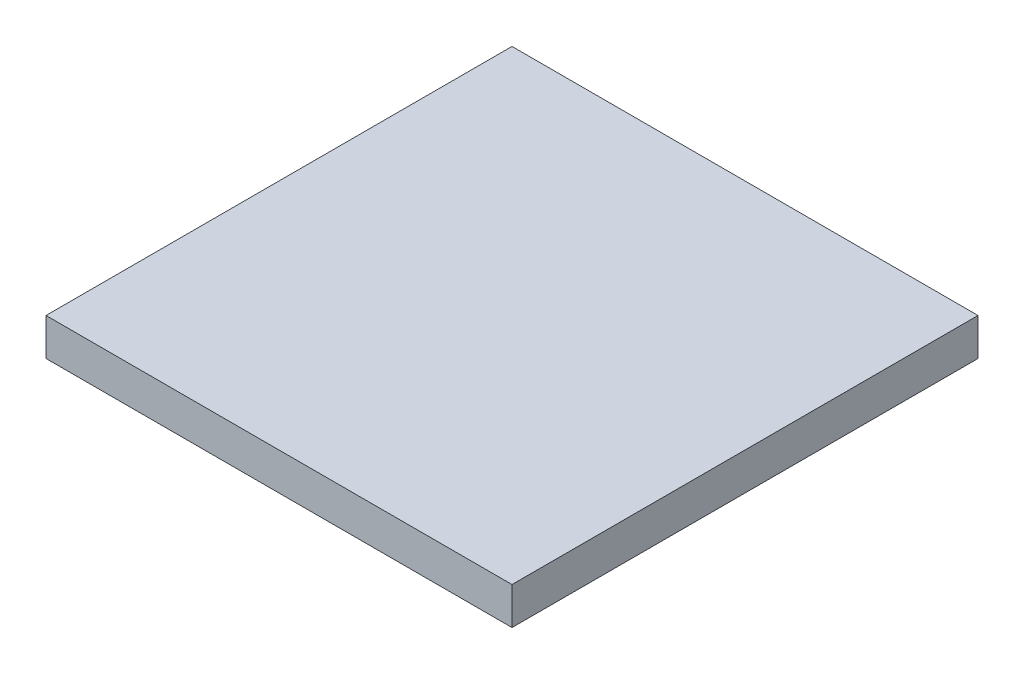
ISO-10303-21;
HEADER;
FILE_DESCRIPTION(('STEP AP214'),'2;1');
FILE_NAME('part.step','',(''),(''),'','','');
FILE_SCHEMA(('AUTOMOTIVE_DESIGN { 1 0 10303 214 1 1 1 1 }'));
ENDSEC;
DATA;
#1=APPLICATION_CONTEXT('core data for automotive mechanical design processes');
#2=APPLICATION_PROTOCOL_DEFINITION('international standard','automotive_design',2000,#1);
#3=PRODUCT_CONTEXT('',#1,'mechanical');
#4=PRODUCT('Part','Part','',(#3));
#5=PRODUCT_RELATED_PRODUCT_CATEGORY('part','',(#4));
#6=PRODUCT_DEFINITION_FORMATION('','',#4);
#7=PRODUCT_DEFINITION_CONTEXT('part definition',#1,'design');
#8=PRODUCT_DEFINITION('design','',#6,#7);
#9=PRODUCT_DEFINITION_SHAPE('','',#8);
#10=(LENGTH_UNIT() NAMED_UNIT(*) SI_UNIT(.MILLI.,.METRE.));
#11=(NAMED_UNIT(*) PLANE_ANGLE_UNIT() SI_UNIT($,.RADIAN.));
#12=(NAMED_UNIT(*) SI_UNIT($,.STERADIAN.) SOLID_ANGLE_UNIT());
#13=UNCERTAINTY_MEASURE_WITH_UNIT(LENGTH_MEASURE(1.E-05),#10,'distance_accuracy_value','');
#14=(GEOMETRIC_REPRESENTATION_CONTEXT(3) GLOBAL_UNCERTAINTY_ASSIGNED_CONTEXT((#13)) GLOBAL_UNIT_ASSIGNED_CONTEXT((#10,
#11,#12)) REPRESENTATION_CONTEXT('',''));
#15=CARTESIAN_POINT('',(0.,0.,0.));
#16=DIRECTION('',(0.,0.,1.));
#17=DIRECTION('',(1.,0.,0.));
#18=AXIS2_PLACEMENT_3D('',#15,#16,#17);
#19=CARTESIAN_POINT('',(12.5,2.,-12.5));
#20=DIRECTION('',(-1.,0.,0.));
#21=DIRECTION('',(0.,0.,1.));
#22=AXIS2_PLACEMENT_3D('',#19,#20,#21);
#23=PLANE('',#22);
#24=DIRECTION('',(0.,0.,-1.));
#25=VECTOR('',#24,1.);
#26=CARTESIAN_POINT('',(12.5,0.,-12.5));
#27=LINE('',#26,#25);
#28=CARTESIAN_POINT('',(12.5,0.,12.5));
#29=VERTEX_POINT('',#28);
#30=CARTESIAN_POINT('',(12.5,0.,-12.5));
#31=VERTEX_POINT('',#30);
#32=EDGE_CURVE('E98',#29,#31,#27,.T.);
#33=ORIENTED_EDGE('',*,*,#32,.T.);
#34=DIRECTION('',(0.,-1.,0.));
#35=VECTOR('',#34,1.);
#36=CARTESIAN_POINT('',(12.5,2.,-12.5));
#37=LINE('',#36,#35);
#38=CARTESIAN_POINT('',(12.5,2.,-12.5));
#39=VERTEX_POINT('',#38);
#40=EDGE_CURVE('E11',#39,#31,#37,.T.);
#41=ORIENTED_EDGE('',*,*,#40,.F.);
#42=DIRECTION('',(0.,0.,-1.));
#43=VECTOR('',#42,1.);
#44=CARTESIAN_POINT('',(12.5,2.,-12.5));
#45=LINE('',#44,#43);
#46=CARTESIAN_POINT('',(12.5,2.,12.5));
#47=VERTEX_POINT('',#46);
#48=EDGE_CURVE('E86',#47,#39,#45,.T.);
#49=ORIENTED_EDGE('',*,*,#48,.F.);
#50=DIRECTION('',(0.,-1.,0.));
#51=VECTOR('',#50,1.);
#52=CARTESIAN_POINT('',(12.5,2.,12.5));
#53=LINE('',#52,#51);
#54=EDGE_CURVE('E94',#47,#29,#53,.T.);
#55=ORIENTED_EDGE('',*,*,#54,.T.);
#56=EDGE_LOOP('',(#33,#41,#49,#55));
#57=FACE_BOUND('',#56,.T.);
#58=ADVANCED_FACE('F35',(#57),#23,.F.);
#59=CARTESIAN_POINT('',(-12.5,2.,-12.5));
#60=DIRECTION('',(0.,0.,1.));
#61=DIRECTION('',(1.,0.,0.));
#62=AXIS2_PLACEMENT_3D('',#59,#60,#61);
#63=PLANE('',#62);
#64=DIRECTION('',(-1.,0.,0.));
#65=VECTOR('',#64,1.);
#66=CARTESIAN_POINT('',(-12.5,0.,-12.5));
#67=LINE('',#66,#65);
#68=CARTESIAN_POINT('',(-12.5,0.,-12.5));
#69=VERTEX_POINT('',#68);
#70=EDGE_CURVE('E90',#31,#69,#67,.T.);
#71=ORIENTED_EDGE('',*,*,#70,.T.);
#72=DIRECTION('',(0.,-1.,0.));
#73=VECTOR('',#72,1.);
#74=CARTESIAN_POINT('',(-12.5,2.,-12.5));
#75=LINE('',#74,#73);
#76=CARTESIAN_POINT('',(-12.5,2.,-12.5));
#77=VERTEX_POINT('',#76);
#78=EDGE_CURVE('E43',#77,#69,#75,.T.);
#79=ORIENTED_EDGE('',*,*,#78,.F.);
#80=DIRECTION('',(-1.,0.,0.));
#81=VECTOR('',#80,1.);
#82=CARTESIAN_POINT('',(-12.5,2.,-12.5));
#83=LINE('',#82,#81);
#84=EDGE_CURVE('E81',#39,#77,#83,.T.);
#85=ORIENTED_EDGE('',*,*,#84,.F.);
#86=ORIENTED_EDGE('',*,*,#40,.T.);
#87=EDGE_LOOP('',(#71,#79,#85,#86));
#88=FACE_BOUND('',#87,.T.);
#89=ADVANCED_FACE('F89',(#88),#63,.F.);
#90=CARTESIAN_POINT('',(-12.5,2.,-12.5));
#91=DIRECTION('',(1.,0.,0.));
#92=DIRECTION('',(0.,0.,-1.));
#93=AXIS2_PLACEMENT_3D('',#90,#91,#92);
#94=PLANE('',#93);
#95=DIRECTION('',(0.,0.,1.));
#96=VECTOR('',#95,1.);
#97=CARTESIAN_POINT('',(-12.5,0.,-12.5));
#98=LINE('',#97,#96);
#99=CARTESIAN_POINT('',(-12.5,0.,12.5));
#100=VERTEX_POINT('',#99);
#101=EDGE_CURVE('E68',#69,#100,#98,.T.);
#102=ORIENTED_EDGE('',*,*,#101,.T.);
#103=DIRECTION('',(0.,-1.,0.));
#104=VECTOR('',#103,1.);
#105=CARTESIAN_POINT('',(-12.5,2.,12.5));
#106=LINE('',#105,#104);
#107=CARTESIAN_POINT('',(-12.5,2.,12.5));
#108=VERTEX_POINT('',#107);
#109=EDGE_CURVE('E91',#108,#100,#106,.T.);
#110=ORIENTED_EDGE('',*,*,#109,.F.);
#111=DIRECTION('',(0.,0.,1.));
#112=VECTOR('',#111,1.);
#113=CARTESIAN_POINT('',(-12.5,2.,-12.5));
#114=LINE('',#113,#112);
#115=EDGE_CURVE('E84',#77,#108,#114,.T.);
#116=ORIENTED_EDGE('',*,*,#115,.F.);
#117=ORIENTED_EDGE('',*,*,#78,.T.);
#118=EDGE_LOOP('',(#102,#110,#116,#117));
#119=FACE_BOUND('',#118,.T.);
#120=ADVANCED_FACE('F92',(#119),#94,.F.);
#121=CARTESIAN_POINT('',(-12.5,2.,12.5));
#122=DIRECTION('',(0.,0.,-1.));
#123=DIRECTION('',(-1.,0.,0.));
#124=AXIS2_PLACEMENT_3D('',#121,#122,#123);
#125=PLANE('',#124);
#126=DIRECTION('',(1.,0.,0.));
#127=VECTOR('',#126,1.);
#128=CARTESIAN_POINT('',(-12.5,0.,12.5));
#129=LINE('',#128,#127);
#130=EDGE_CURVE('E74',#100,#29,#129,.T.);
#131=ORIENTED_EDGE('',*,*,#130,.T.);
#132=ORIENTED_EDGE('',*,*,#54,.F.);
#133=DIRECTION('',(1.,0.,0.));
#134=VECTOR('',#133,1.);
#135=CARTESIAN_POINT('',(-12.5,2.,12.5));
#136=LINE('',#135,#134);
#137=EDGE_CURVE('E51',#108,#47,#136,.T.);
#138=ORIENTED_EDGE('',*,*,#137,.F.);
#139=ORIENTED_EDGE('',*,*,#109,.T.);
#140=EDGE_LOOP('',(#131,#132,#138,#139));
#141=FACE_BOUND('',#140,.T.);
#142=ADVANCED_FACE('F105',(#141),#125,.F.);
#143=CARTESIAN_POINT('',(0.,2.,0.));
#144=DIRECTION('',(0.,1.,0.));
#145=DIRECTION('',(0.,0.,1.));
#146=AXIS2_PLACEMENT_3D('',#143,#144,#145);
#147=PLANE('',#146);
#148=ORIENTED_EDGE('',*,*,#48,.T.);
#149=ORIENTED_EDGE('',*,*,#84,.T.);
#150=ORIENTED_EDGE('',*,*,#115,.T.);
#151=ORIENTED_EDGE('',*,*,#137,.T.);
#152=EDGE_LOOP('',(#148,#149,#150,#151));
#153=FACE_BOUND('',#152,.T.);
#154=ADVANCED_FACE('F82',(#153),#147,.T.);
#155=CARTESIAN_POINT('',(0.,0.,0.));
#156=DIRECTION('',(0.,1.,0.));
#157=DIRECTION('',(0.,0.,1.));
#158=AXIS2_PLACEMENT_3D('',#155,#156,#157);
#159=PLANE('',#158);
#160=ORIENTED_EDGE('',*,*,#32,.F.);
#161=ORIENTED_EDGE('',*,*,#130,.F.);
#162=ORIENTED_EDGE('',*,*,#101,.F.);
#163=ORIENTED_EDGE('',*,*,#70,.F.);
#164=EDGE_LOOP('',(#160,#161,#162,#163));
#165=FACE_BOUND('',#164,.T.);
#166=ADVANCED_FACE('F108',(#165),#159,.F.);
#167=CLOSED_SHELL('',(#58,#89,#120,#142,#154,#166));
#168=MANIFOLD_SOLID_BREP('B2',#167);
#169=ADVANCED_BREP_SHAPE_REPRESENTATION('',(#18,#168),#14);
#170=SHAPE_DEFINITION_REPRESENTATION(#9,#169);
ENDSEC;
END-ISO-10303-21;
